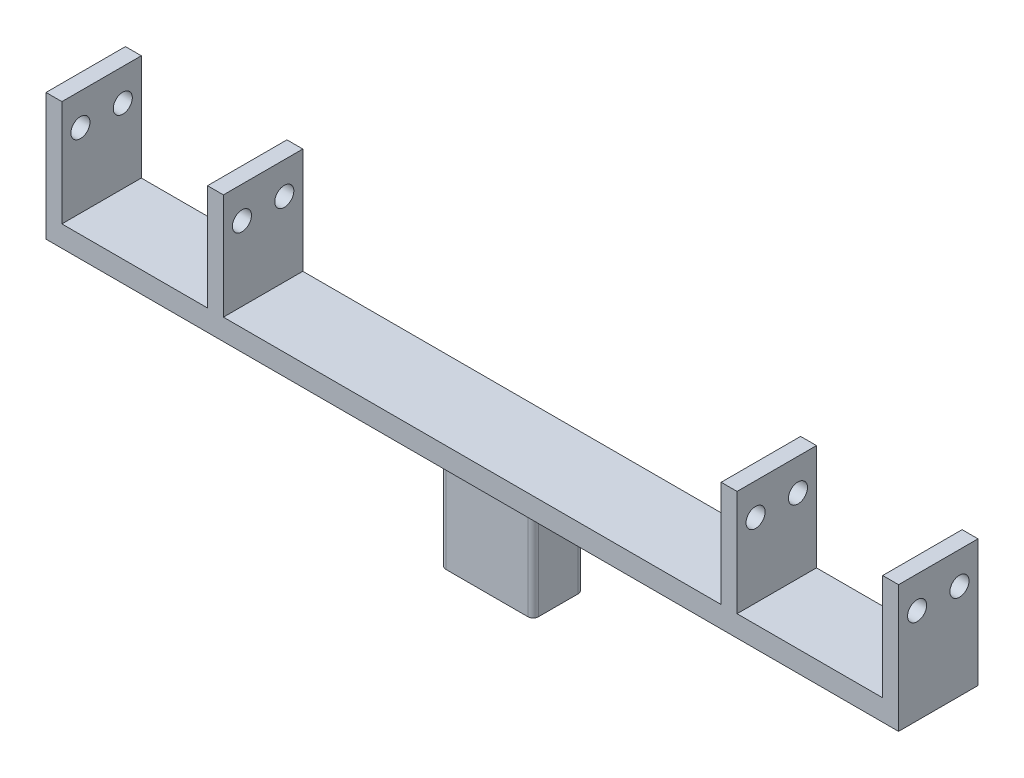
ISO-10303-21;
HEADER;
FILE_DESCRIPTION(('STEP AP214'),'2;1');
FILE_NAME('part.step','',(''),(''),'','','');
FILE_SCHEMA(('AUTOMOTIVE_DESIGN { 1 0 10303 214 1 1 1 1 }'));
ENDSEC;
DATA;
#1=APPLICATION_CONTEXT('core data for automotive mechanical design processes');
#2=APPLICATION_PROTOCOL_DEFINITION('international standard','automotive_design',2000,#1);
#3=PRODUCT_CONTEXT('',#1,'mechanical');
#4=PRODUCT('Part','Part','',(#3));
#5=PRODUCT_RELATED_PRODUCT_CATEGORY('part','',(#4));
#6=PRODUCT_DEFINITION_FORMATION('','',#4);
#7=PRODUCT_DEFINITION_CONTEXT('part definition',#1,'design');
#8=PRODUCT_DEFINITION('design','',#6,#7);
#9=PRODUCT_DEFINITION_SHAPE('','',#8);
#10=(LENGTH_UNIT() NAMED_UNIT(*) SI_UNIT(.MILLI.,.METRE.));
#11=(NAMED_UNIT(*) PLANE_ANGLE_UNIT() SI_UNIT($,.RADIAN.));
#12=(NAMED_UNIT(*) SI_UNIT($,.STERADIAN.) SOLID_ANGLE_UNIT());
#13=UNCERTAINTY_MEASURE_WITH_UNIT(LENGTH_MEASURE(1.E-05),#10,'distance_accuracy_value','');
#14=(GEOMETRIC_REPRESENTATION_CONTEXT(3) GLOBAL_UNCERTAINTY_ASSIGNED_CONTEXT((#13)) GLOBAL_UNIT_ASSIGNED_CONTEXT((#10,
#11,#12)) REPRESENTATION_CONTEXT('',''));
#15=CARTESIAN_POINT('',(0.,0.,0.));
#16=DIRECTION('',(0.,0.,1.));
#17=DIRECTION('',(1.,0.,0.));
#18=AXIS2_PLACEMENT_3D('',#15,#16,#17);
#19=CARTESIAN_POINT('',(0.,0.,0.));
#20=DIRECTION('',(0.,-1.,0.));
#21=DIRECTION('',(0.,0.,-1.));
#22=AXIS2_PLACEMENT_3D('',#19,#20,#21);
#23=PLANE('',#22);
#24=DIRECTION('',(0.,0.,-1.));
#25=VECTOR('',#24,1.);
#26=CARTESIAN_POINT('',(80.5,0.,7.5));
#27=LINE('',#26,#25);
#28=CARTESIAN_POINT('',(80.5,0.,7.5));
#29=VERTEX_POINT('',#28);
#30=CARTESIAN_POINT('',(80.5,0.,-7.5));
#31=VERTEX_POINT('',#30);
#32=EDGE_CURVE('E361',#29,#31,#27,.T.);
#33=ORIENTED_EDGE('',*,*,#32,.F.);
#34=DIRECTION('',(1.,0.,0.));
#35=VECTOR('',#34,1.);
#36=CARTESIAN_POINT('',(-80.5,0.,7.5));
#37=LINE('',#36,#35);
#38=CARTESIAN_POINT('',(-80.5,0.,7.5));
#39=VERTEX_POINT('',#38);
#40=EDGE_CURVE('E377',#39,#29,#37,.T.);
#41=ORIENTED_EDGE('',*,*,#40,.F.);
#42=DIRECTION('',(0.,0.,1.));
#43=VECTOR('',#42,1.);
#44=CARTESIAN_POINT('',(-80.5,0.,7.5));
#45=LINE('',#44,#43);
#46=CARTESIAN_POINT('',(-80.5,0.,-7.5));
#47=VERTEX_POINT('',#46);
#48=EDGE_CURVE('E375',#47,#39,#45,.T.);
#49=ORIENTED_EDGE('',*,*,#48,.F.);
#50=DIRECTION('',(-1.,0.,0.));
#51=VECTOR('',#50,1.);
#52=CARTESIAN_POINT('',(-80.5,0.,-7.5));
#53=LINE('',#52,#51);
#54=EDGE_CURVE('E373',#31,#47,#53,.T.);
#55=ORIENTED_EDGE('',*,*,#54,.F.);
#56=EDGE_LOOP('',(#33,#41,#49,#55));
#57=FACE_BOUND('',#56,.T.);
#58=DIRECTION('',(0.,0.,-1.));
#59=VECTOR('',#58,1.);
#60=CARTESIAN_POINT('',(-8.75,0.,-3.74999999999999));
#61=LINE('',#60,#59);
#62=CARTESIAN_POINT('',(-8.75,0.,3.74999999999999));
#63=VERTEX_POINT('',#62);
#64=CARTESIAN_POINT('',(-8.75,0.,-3.74999999999999));
#65=VERTEX_POINT('',#64);
#66=EDGE_CURVE('E702',#63,#65,#61,.T.);
#67=ORIENTED_EDGE('',*,*,#66,.F.);
#68=CARTESIAN_POINT('',(-7.75,0.,3.75));
#69=DIRECTION('',(0.,-1.,0.));
#70=DIRECTION('',(0.,0.,1.));
#71=AXIS2_PLACEMENT_3D('',#68,#69,#70);
#72=CIRCLE('',#71,1.);
#73=CARTESIAN_POINT('',(-7.74999999999999,0.,4.75));
#74=VERTEX_POINT('',#73);
#75=EDGE_CURVE('E221',#74,#63,#72,.T.);
#76=ORIENTED_EDGE('',*,*,#75,.F.);
#77=DIRECTION('',(-1.,0.,0.));
#78=VECTOR('',#77,1.);
#79=CARTESIAN_POINT('',(-7.74999999999999,0.,4.75));
#80=LINE('',#79,#78);
#81=CARTESIAN_POINT('',(7.74999999999999,0.,4.75));
#82=VERTEX_POINT('',#81);
#83=EDGE_CURVE('E217',#82,#74,#80,.T.);
#84=ORIENTED_EDGE('',*,*,#83,.F.);
#85=CARTESIAN_POINT('',(7.75,0.,3.75));
#86=DIRECTION('',(0.,-1.,0.));
#87=DIRECTION('',(0.,0.,-1.));
#88=AXIS2_PLACEMENT_3D('',#85,#86,#87);
#89=CIRCLE('',#88,1.);
#90=CARTESIAN_POINT('',(8.75,0.,3.74999999999999));
#91=VERTEX_POINT('',#90);
#92=EDGE_CURVE('E698',#91,#82,#89,.T.);
#93=ORIENTED_EDGE('',*,*,#92,.F.);
#94=DIRECTION('',(0.,0.,1.));
#95=VECTOR('',#94,1.);
#96=CARTESIAN_POINT('',(8.75,0.,-3.74999999999999));
#97=LINE('',#96,#95);
#98=CARTESIAN_POINT('',(8.75,0.,-3.74999999999999));
#99=VERTEX_POINT('',#98);
#100=EDGE_CURVE('E714',#99,#91,#97,.T.);
#101=ORIENTED_EDGE('',*,*,#100,.F.);
#102=CARTESIAN_POINT('',(7.75,0.,-3.75));
#103=DIRECTION('',(0.,-1.,0.));
#104=DIRECTION('',(0.,0.,1.));
#105=AXIS2_PLACEMENT_3D('',#102,#103,#104);
#106=CIRCLE('',#105,1.);
#107=CARTESIAN_POINT('',(7.74999999999999,0.,-4.75));
#108=VERTEX_POINT('',#107);
#109=EDGE_CURVE('E712',#108,#99,#106,.T.);
#110=ORIENTED_EDGE('',*,*,#109,.F.);
#111=DIRECTION('',(1.,0.,0.));
#112=VECTOR('',#111,1.);
#113=CARTESIAN_POINT('',(-7.74999999999999,0.,-4.75));
#114=LINE('',#113,#112);
#115=CARTESIAN_POINT('',(-7.74999999999999,0.,-4.75));
#116=VERTEX_POINT('',#115);
#117=EDGE_CURVE('E710',#116,#108,#114,.T.);
#118=ORIENTED_EDGE('',*,*,#117,.F.);
#119=CARTESIAN_POINT('',(-7.75,0.,-3.75));
#120=DIRECTION('',(0.,-1.,0.));
#121=DIRECTION('',(0.,0.,1.));
#122=AXIS2_PLACEMENT_3D('',#119,#120,#121);
#123=CIRCLE('',#122,1.);
#124=EDGE_CURVE('E704',#65,#116,#123,.T.);
#125=ORIENTED_EDGE('',*,*,#124,.F.);
#126=EDGE_LOOP('',(#67,#76,#84,#93,#101,#110,#118,#125));
#127=FACE_BOUND('',#126,.T.);
#128=ADVANCED_FACE('F35',(#57,#127),#23,.T.);
#129=CARTESIAN_POINT('',(0.,4.,0.));
#130=DIRECTION('',(0.,-1.,0.));
#131=DIRECTION('',(0.,0.,-1.));
#132=AXIS2_PLACEMENT_3D('',#129,#130,#131);
#133=PLANE('',#132);
#134=DIRECTION('',(0.,0.,-1.));
#135=VECTOR('',#134,1.);
#136=CARTESIAN_POINT('',(50.,4.,-7.5));
#137=LINE('',#136,#135);
#138=CARTESIAN_POINT('',(50.,4.,7.5));
#139=VERTEX_POINT('',#138);
#140=CARTESIAN_POINT('',(50.,4.,-7.5));
#141=VERTEX_POINT('',#140);
#142=EDGE_CURVE('E271',#139,#141,#137,.T.);
#143=ORIENTED_EDGE('',*,*,#142,.F.);
#144=DIRECTION('',(1.,0.,0.));
#145=VECTOR('',#144,1.);
#146=CARTESIAN_POINT('',(-80.5,4.,7.5));
#147=LINE('',#146,#145);
#148=CARTESIAN_POINT('',(77.5,4.,7.5));
#149=VERTEX_POINT('',#148);
#150=EDGE_CURVE('E364',#139,#149,#147,.T.);
#151=ORIENTED_EDGE('',*,*,#150,.T.);
#152=DIRECTION('',(0.,0.,1.));
#153=VECTOR('',#152,1.);
#154=CARTESIAN_POINT('',(77.5,4.,-7.5));
#155=LINE('',#154,#153);
#156=CARTESIAN_POINT('',(77.5,4.,-7.5));
#157=VERTEX_POINT('',#156);
#158=EDGE_CURVE('E296',#157,#149,#155,.T.);
#159=ORIENTED_EDGE('',*,*,#158,.F.);
#160=DIRECTION('',(-1.,0.,0.));
#161=VECTOR('',#160,1.);
#162=CARTESIAN_POINT('',(-80.5,4.,-7.5));
#163=LINE('',#162,#161);
#164=EDGE_CURVE('E362',#157,#141,#163,.T.);
#165=ORIENTED_EDGE('',*,*,#164,.T.);
#166=EDGE_LOOP('',(#143,#151,#159,#165));
#167=FACE_BOUND('',#166,.T.);
#168=ADVANCED_FACE('F412',(#167),#133,.F.);
#169=DIRECTION('',(0.,0.,1.));
#170=VECTOR('',#169,1.);
#171=CARTESIAN_POINT('',(47.,4.,-7.5));
#172=LINE('',#171,#170);
#173=CARTESIAN_POINT('',(47.,4.,-7.5));
#174=VERTEX_POINT('',#173);
#175=CARTESIAN_POINT('',(47.,4.,7.5));
#176=VERTEX_POINT('',#175);
#177=EDGE_CURVE('E60',#174,#176,#172,.T.);
#178=ORIENTED_EDGE('',*,*,#177,.F.);
#179=CARTESIAN_POINT('',(-47.,4.,-7.5));
#180=VERTEX_POINT('',#179);
#181=EDGE_CURVE('E365',#174,#180,#163,.T.);
#182=ORIENTED_EDGE('',*,*,#181,.T.);
#183=DIRECTION('',(0.,0.,-1.));
#184=VECTOR('',#183,1.);
#185=CARTESIAN_POINT('',(-47.,4.,-7.5));
#186=LINE('',#185,#184);
#187=CARTESIAN_POINT('',(-47.,4.,7.5));
#188=VERTEX_POINT('',#187);
#189=EDGE_CURVE('E339',#188,#180,#186,.T.);
#190=ORIENTED_EDGE('',*,*,#189,.F.);
#191=EDGE_CURVE('E370',#188,#176,#147,.T.);
#192=ORIENTED_EDGE('',*,*,#191,.T.);
#193=EDGE_LOOP('',(#178,#182,#190,#192));
#194=FACE_BOUND('',#193,.T.);
#195=ADVANCED_FACE('F427',(#194),#133,.F.);
#196=DIRECTION('',(0.,0.,-1.));
#197=VECTOR('',#196,1.);
#198=CARTESIAN_POINT('',(-77.5,4.,-7.5));
#199=LINE('',#198,#197);
#200=CARTESIAN_POINT('',(-77.5,4.,7.5));
#201=VERTEX_POINT('',#200);
#202=CARTESIAN_POINT('',(-77.5,4.,-7.5));
#203=VERTEX_POINT('',#202);
#204=EDGE_CURVE('E315',#201,#203,#199,.T.);
#205=ORIENTED_EDGE('',*,*,#204,.F.);
#206=CARTESIAN_POINT('',(-50.,4.,7.5));
#207=VERTEX_POINT('',#206);
#208=EDGE_CURVE('E367',#201,#207,#147,.T.);
#209=ORIENTED_EDGE('',*,*,#208,.T.);
#210=DIRECTION('',(0.,0.,1.));
#211=VECTOR('',#210,1.);
#212=CARTESIAN_POINT('',(-50.,4.,-7.5));
#213=LINE('',#212,#211);
#214=CARTESIAN_POINT('',(-50.,4.,-7.5));
#215=VERTEX_POINT('',#214);
#216=EDGE_CURVE('E334',#215,#207,#213,.T.);
#217=ORIENTED_EDGE('',*,*,#216,.F.);
#218=EDGE_CURVE('E366',#215,#203,#163,.T.);
#219=ORIENTED_EDGE('',*,*,#218,.T.);
#220=EDGE_LOOP('',(#205,#209,#217,#219));
#221=FACE_BOUND('',#220,.T.);
#222=ADVANCED_FACE('F444',(#221),#133,.F.);
#223=CARTESIAN_POINT('',(80.5,4.,7.5));
#224=DIRECTION('',(-1.,0.,0.));
#225=DIRECTION('',(0.,0.,1.));
#226=AXIS2_PLACEMENT_3D('',#223,#224,#225);
#227=PLANE('',#226);
#228=CARTESIAN_POINT('',(80.5,18.,4.));
#229=DIRECTION('',(-1.,0.,0.));
#230=DIRECTION('',(0.,0.,1.));
#231=AXIS2_PLACEMENT_3D('',#228,#229,#230);
#232=CIRCLE('',#231,1.8);
#233=CARTESIAN_POINT('',(80.5,18.,5.8));
#234=VERTEX_POINT('',#233);
#235=EDGE_CURVE('E226',#234,#234,#232,.T.);
#236=ORIENTED_EDGE('',*,*,#235,.T.);
#237=EDGE_LOOP('',(#236));
#238=FACE_BOUND('',#237,.T.);
#239=CARTESIAN_POINT('',(80.5,18.,-4.));
#240=DIRECTION('',(-1.,0.,0.));
#241=DIRECTION('',(0.,0.,1.));
#242=AXIS2_PLACEMENT_3D('',#239,#240,#241);
#243=CIRCLE('',#242,1.8);
#244=CARTESIAN_POINT('',(80.5,18.,-2.2));
#245=VERTEX_POINT('',#244);
#246=EDGE_CURVE('E223',#245,#245,#243,.T.);
#247=ORIENTED_EDGE('',*,*,#246,.T.);
#248=EDGE_LOOP('',(#247));
#249=FACE_BOUND('',#248,.T.);
#250=ORIENTED_EDGE('',*,*,#32,.T.);
#251=DIRECTION('',(0.,-1.,0.));
#252=VECTOR('',#251,1.);
#253=CARTESIAN_POINT('',(80.5,4.,-7.5));
#254=LINE('',#253,#252);
#255=CARTESIAN_POINT('',(80.5,24.,-7.5));
#256=VERTEX_POINT('',#255);
#257=EDGE_CURVE('E11',#256,#31,#254,.T.);
#258=ORIENTED_EDGE('',*,*,#257,.F.);
#259=DIRECTION('',(0.,0.,-1.));
#260=VECTOR('',#259,1.);
#261=CARTESIAN_POINT('',(80.5,24.,-7.5));
#262=LINE('',#261,#260);
#263=CARTESIAN_POINT('',(80.5,24.,7.5));
#264=VERTEX_POINT('',#263);
#265=EDGE_CURVE('E297',#264,#256,#262,.T.);
#266=ORIENTED_EDGE('',*,*,#265,.F.);
#267=DIRECTION('',(0.,-1.,0.));
#268=VECTOR('',#267,1.);
#269=CARTESIAN_POINT('',(80.5,4.,7.5));
#270=LINE('',#269,#268);
#271=EDGE_CURVE('E369',#264,#29,#270,.T.);
#272=ORIENTED_EDGE('',*,*,#271,.T.);
#273=EDGE_LOOP('',(#250,#258,#266,#272));
#274=FACE_BOUND('',#273,.T.);
#275=ADVANCED_FACE('F37',(#238,#249,#274),#227,.F.);
#276=CARTESIAN_POINT('',(-80.5,4.,-7.5));
#277=DIRECTION('',(0.,0.,1.));
#278=DIRECTION('',(1.,0.,0.));
#279=AXIS2_PLACEMENT_3D('',#276,#277,#278);
#280=PLANE('',#279);
#281=ORIENTED_EDGE('',*,*,#54,.T.);
#282=DIRECTION('',(0.,-1.,0.));
#283=VECTOR('',#282,1.);
#284=CARTESIAN_POINT('',(-80.5,4.,-7.5));
#285=LINE('',#284,#283);
#286=CARTESIAN_POINT('',(-80.5,24.,-7.5));
#287=VERTEX_POINT('',#286);
#288=EDGE_CURVE('E44',#287,#47,#285,.T.);
#289=ORIENTED_EDGE('',*,*,#288,.F.);
#290=DIRECTION('',(-1.,0.,0.));
#291=VECTOR('',#290,1.);
#292=CARTESIAN_POINT('',(-80.5,24.,-7.5));
#293=LINE('',#292,#291);
#294=CARTESIAN_POINT('',(-77.5,24.,-7.5));
#295=VERTEX_POINT('',#294);
#296=EDGE_CURVE('E323',#295,#287,#293,.T.);
#297=ORIENTED_EDGE('',*,*,#296,.F.);
#298=DIRECTION('',(0.,-1.,0.));
#299=VECTOR('',#298,1.);
#300=CARTESIAN_POINT('',(-77.5,24.,-7.5));
#301=LINE('',#300,#299);
#302=EDGE_CURVE('E326',#295,#203,#301,.T.);
#303=ORIENTED_EDGE('',*,*,#302,.T.);
#304=ORIENTED_EDGE('',*,*,#218,.F.);
#305=DIRECTION('',(0.,-1.,0.));
#306=VECTOR('',#305,1.);
#307=CARTESIAN_POINT('',(-50.,24.,-7.5));
#308=LINE('',#307,#306);
#309=CARTESIAN_POINT('',(-50.,24.,-7.5));
#310=VERTEX_POINT('',#309);
#311=EDGE_CURVE('E345',#310,#215,#308,.T.);
#312=ORIENTED_EDGE('',*,*,#311,.F.);
#313=DIRECTION('',(-1.,0.,0.));
#314=VECTOR('',#313,1.);
#315=CARTESIAN_POINT('',(-50.,24.,-7.5));
#316=LINE('',#315,#314);
#317=CARTESIAN_POINT('',(-47.,24.,-7.5));
#318=VERTEX_POINT('',#317);
#319=EDGE_CURVE('E343',#318,#310,#316,.T.);
#320=ORIENTED_EDGE('',*,*,#319,.F.);
#321=DIRECTION('',(0.,-1.,0.));
#322=VECTOR('',#321,1.);
#323=CARTESIAN_POINT('',(-47.,24.,-7.5));
#324=LINE('',#323,#322);
#325=EDGE_CURVE('E352',#318,#180,#324,.T.);
#326=ORIENTED_EDGE('',*,*,#325,.T.);
#327=ORIENTED_EDGE('',*,*,#181,.F.);
#328=DIRECTION('',(0.,-1.,0.));
#329=VECTOR('',#328,1.);
#330=CARTESIAN_POINT('',(47.,24.,-7.5));
#331=LINE('',#330,#329);
#332=CARTESIAN_POINT('',(47.,24.,-7.5));
#333=VERTEX_POINT('',#332);
#334=EDGE_CURVE('E290',#333,#174,#331,.T.);
#335=ORIENTED_EDGE('',*,*,#334,.F.);
#336=DIRECTION('',(-1.,0.,0.));
#337=VECTOR('',#336,1.);
#338=CARTESIAN_POINT('',(50.,24.,-7.5));
#339=LINE('',#338,#337);
#340=CARTESIAN_POINT('',(50.,24.,-7.5));
#341=VERTEX_POINT('',#340);
#342=EDGE_CURVE('E275',#341,#333,#339,.T.);
#343=ORIENTED_EDGE('',*,*,#342,.F.);
#344=DIRECTION('',(0.,-1.,0.));
#345=VECTOR('',#344,1.);
#346=CARTESIAN_POINT('',(50.,24.,-7.5));
#347=LINE('',#346,#345);
#348=EDGE_CURVE('E293',#341,#141,#347,.T.);
#349=ORIENTED_EDGE('',*,*,#348,.T.);
#350=ORIENTED_EDGE('',*,*,#164,.F.);
#351=DIRECTION('',(0.,-1.,0.));
#352=VECTOR('',#351,1.);
#353=CARTESIAN_POINT('',(77.5,24.,-7.5));
#354=LINE('',#353,#352);
#355=CARTESIAN_POINT('',(77.5,24.,-7.5));
#356=VERTEX_POINT('',#355);
#357=EDGE_CURVE('E312',#356,#157,#354,.T.);
#358=ORIENTED_EDGE('',*,*,#357,.F.);
#359=DIRECTION('',(-1.,0.,0.));
#360=VECTOR('',#359,1.);
#361=CARTESIAN_POINT('',(80.5,24.,-7.5));
#362=LINE('',#361,#360);
#363=EDGE_CURVE('E300',#256,#356,#362,.T.);
#364=ORIENTED_EDGE('',*,*,#363,.F.);
#365=ORIENTED_EDGE('',*,*,#257,.T.);
#366=EDGE_LOOP('',(#281,#289,#297,#303,#304,#312,#320,#326,#327,#335,#343,#349,#350,#358,#364,#365));
#367=FACE_BOUND('',#366,.T.);
#368=ADVANCED_FACE('F416',(#367),#280,.F.);
#369=CARTESIAN_POINT('',(-80.5,4.,7.5));
#370=DIRECTION('',(1.,0.,0.));
#371=DIRECTION('',(0.,0.,-1.));
#372=AXIS2_PLACEMENT_3D('',#369,#370,#371);
#373=PLANE('',#372);
#374=CARTESIAN_POINT('',(-80.5,18.,4.));
#375=DIRECTION('',(1.,0.,0.));
#376=DIRECTION('',(0.,0.,-1.));
#377=AXIS2_PLACEMENT_3D('',#374,#375,#376);
#378=CIRCLE('',#377,1.8);
#379=CARTESIAN_POINT('',(-80.5,18.,2.2));
#380=VERTEX_POINT('',#379);
#381=EDGE_CURVE('E268',#380,#380,#378,.T.);
#382=ORIENTED_EDGE('',*,*,#381,.T.);
#383=EDGE_LOOP('',(#382));
#384=FACE_BOUND('',#383,.T.);
#385=CARTESIAN_POINT('',(-80.5,18.,-4.));
#386=DIRECTION('',(1.,0.,0.));
#387=DIRECTION('',(0.,0.,-1.));
#388=AXIS2_PLACEMENT_3D('',#385,#386,#387);
#389=CIRCLE('',#388,1.8);
#390=CARTESIAN_POINT('',(-80.5,18.,-5.8));
#391=VERTEX_POINT('',#390);
#392=EDGE_CURVE('E250',#391,#391,#389,.T.);
#393=ORIENTED_EDGE('',*,*,#392,.T.);
#394=EDGE_LOOP('',(#393));
#395=FACE_BOUND('',#394,.T.);
#396=ORIENTED_EDGE('',*,*,#48,.T.);
#397=DIRECTION('',(0.,-1.,0.));
#398=VECTOR('',#397,1.);
#399=CARTESIAN_POINT('',(-80.5,4.,7.5));
#400=LINE('',#399,#398);
#401=CARTESIAN_POINT('',(-80.5,24.,7.5));
#402=VERTEX_POINT('',#401);
#403=EDGE_CURVE('E381',#402,#39,#400,.T.);
#404=ORIENTED_EDGE('',*,*,#403,.F.);
#405=DIRECTION('',(0.,0.,1.));
#406=VECTOR('',#405,1.);
#407=CARTESIAN_POINT('',(-80.5,24.,-7.5));
#408=LINE('',#407,#406);
#409=EDGE_CURVE('E316',#287,#402,#408,.T.);
#410=ORIENTED_EDGE('',*,*,#409,.F.);
#411=ORIENTED_EDGE('',*,*,#288,.T.);
#412=EDGE_LOOP('',(#396,#404,#410,#411));
#413=FACE_BOUND('',#412,.T.);
#414=ADVANCED_FACE('F452',(#384,#395,#413),#373,.F.);
#415=CARTESIAN_POINT('',(-80.5,4.,7.5));
#416=DIRECTION('',(0.,0.,-1.));
#417=DIRECTION('',(-1.,0.,0.));
#418=AXIS2_PLACEMENT_3D('',#415,#416,#417);
#419=PLANE('',#418);
#420=ORIENTED_EDGE('',*,*,#40,.T.);
#421=ORIENTED_EDGE('',*,*,#271,.F.);
#422=DIRECTION('',(1.,0.,0.));
#423=VECTOR('',#422,1.);
#424=CARTESIAN_POINT('',(80.5,24.,7.5));
#425=LINE('',#424,#423);
#426=CARTESIAN_POINT('',(77.5,24.,7.5));
#427=VERTEX_POINT('',#426);
#428=EDGE_CURVE('E304',#427,#264,#425,.T.);
#429=ORIENTED_EDGE('',*,*,#428,.F.);
#430=DIRECTION('',(0.,-1.,0.));
#431=VECTOR('',#430,1.);
#432=CARTESIAN_POINT('',(77.5,24.,7.5));
#433=LINE('',#432,#431);
#434=EDGE_CURVE('E307',#427,#149,#433,.T.);
#435=ORIENTED_EDGE('',*,*,#434,.T.);
#436=ORIENTED_EDGE('',*,*,#150,.F.);
#437=DIRECTION('',(0.,-1.,0.));
#438=VECTOR('',#437,1.);
#439=CARTESIAN_POINT('',(50.,24.,7.5));
#440=LINE('',#439,#438);
#441=CARTESIAN_POINT('',(50.,24.,7.5));
#442=VERTEX_POINT('',#441);
#443=EDGE_CURVE('E281',#442,#139,#440,.T.);
#444=ORIENTED_EDGE('',*,*,#443,.F.);
#445=DIRECTION('',(1.,0.,0.));
#446=VECTOR('',#445,1.);
#447=CARTESIAN_POINT('',(50.,24.,7.5));
#448=LINE('',#447,#446);
#449=CARTESIAN_POINT('',(47.,24.,7.5));
#450=VERTEX_POINT('',#449);
#451=EDGE_CURVE('E279',#450,#442,#448,.T.);
#452=ORIENTED_EDGE('',*,*,#451,.F.);
#453=DIRECTION('',(0.,-1.,0.));
#454=VECTOR('',#453,1.);
#455=CARTESIAN_POINT('',(47.,24.,7.5));
#456=LINE('',#455,#454);
#457=EDGE_CURVE('E287',#450,#176,#456,.T.);
#458=ORIENTED_EDGE('',*,*,#457,.T.);
#459=ORIENTED_EDGE('',*,*,#191,.F.);
#460=DIRECTION('',(0.,-1.,0.));
#461=VECTOR('',#460,1.);
#462=CARTESIAN_POINT('',(-47.,24.,7.5));
#463=LINE('',#462,#461);
#464=CARTESIAN_POINT('',(-47.,24.,7.5));
#465=VERTEX_POINT('',#464);
#466=EDGE_CURVE('E355',#465,#188,#463,.T.);
#467=ORIENTED_EDGE('',*,*,#466,.F.);
#468=DIRECTION('',(1.,0.,0.));
#469=VECTOR('',#468,1.);
#470=CARTESIAN_POINT('',(-50.,24.,7.5));
#471=LINE('',#470,#469);
#472=CARTESIAN_POINT('',(-50.,24.,7.5));
#473=VERTEX_POINT('',#472);
#474=EDGE_CURVE('E338',#473,#465,#471,.T.);
#475=ORIENTED_EDGE('',*,*,#474,.F.);
#476=DIRECTION('',(0.,-1.,0.));
#477=VECTOR('',#476,1.);
#478=CARTESIAN_POINT('',(-50.,24.,7.5));
#479=LINE('',#478,#477);
#480=EDGE_CURVE('E358',#473,#207,#479,.T.);
#481=ORIENTED_EDGE('',*,*,#480,.T.);
#482=ORIENTED_EDGE('',*,*,#208,.F.);
#483=DIRECTION('',(0.,-1.,0.));
#484=VECTOR('',#483,1.);
#485=CARTESIAN_POINT('',(-77.5,24.,7.5));
#486=LINE('',#485,#484);
#487=CARTESIAN_POINT('',(-77.5,24.,7.5));
#488=VERTEX_POINT('',#487);
#489=EDGE_CURVE('E331',#488,#201,#486,.T.);
#490=ORIENTED_EDGE('',*,*,#489,.F.);
#491=DIRECTION('',(1.,0.,0.));
#492=VECTOR('',#491,1.);
#493=CARTESIAN_POINT('',(-80.5,24.,7.5));
#494=LINE('',#493,#492);
#495=EDGE_CURVE('E319',#402,#488,#494,.T.);
#496=ORIENTED_EDGE('',*,*,#495,.F.);
#497=ORIENTED_EDGE('',*,*,#403,.T.);
#498=EDGE_LOOP('',(#420,#421,#429,#435,#436,#444,#452,#458,#459,#467,#475,#481,#482,#490,#496,#497));
#499=FACE_BOUND('',#498,.T.);
#500=ADVANCED_FACE('F423',(#499),#419,.F.);
#501=CARTESIAN_POINT('',(-50.,24.,-7.5));
#502=DIRECTION('',(1.,0.,0.));
#503=DIRECTION('',(0.,0.,-1.));
#504=AXIS2_PLACEMENT_3D('',#501,#502,#503);
#505=PLANE('',#504);
#506=CARTESIAN_POINT('',(-50.,18.,4.));
#507=DIRECTION('',(1.,0.,0.));
#508=DIRECTION('',(0.,0.,-1.));
#509=AXIS2_PLACEMENT_3D('',#506,#507,#508);
#510=CIRCLE('',#509,1.8);
#511=CARTESIAN_POINT('',(-50.,18.,2.2));
#512=VERTEX_POINT('',#511);
#513=EDGE_CURVE('E265',#512,#512,#510,.T.);
#514=ORIENTED_EDGE('',*,*,#513,.T.);
#515=EDGE_LOOP('',(#514));
#516=FACE_BOUND('',#515,.T.);
#517=CARTESIAN_POINT('',(-50.,18.,-4.));
#518=DIRECTION('',(1.,0.,0.));
#519=DIRECTION('',(0.,0.,-1.));
#520=AXIS2_PLACEMENT_3D('',#517,#518,#519);
#521=CIRCLE('',#520,1.8);
#522=CARTESIAN_POINT('',(-50.,18.,-5.8));
#523=VERTEX_POINT('',#522);
#524=EDGE_CURVE('E247',#523,#523,#521,.T.);
#525=ORIENTED_EDGE('',*,*,#524,.T.);
#526=EDGE_LOOP('',(#525));
#527=FACE_BOUND('',#526,.T.);
#528=ORIENTED_EDGE('',*,*,#216,.T.);
#529=ORIENTED_EDGE('',*,*,#480,.F.);
#530=DIRECTION('',(0.,0.,1.));
#531=VECTOR('',#530,1.);
#532=CARTESIAN_POINT('',(-50.,24.,-7.5));
#533=LINE('',#532,#531);
#534=EDGE_CURVE('E335',#310,#473,#533,.T.);
#535=ORIENTED_EDGE('',*,*,#534,.F.);
#536=ORIENTED_EDGE('',*,*,#311,.T.);
#537=EDGE_LOOP('',(#528,#529,#535,#536));
#538=FACE_BOUND('',#537,.T.);
#539=ADVANCED_FACE('F451',(#516,#527,#538),#505,.F.);
#540=CARTESIAN_POINT('',(-47.,24.,-7.5));
#541=DIRECTION('',(-1.,0.,0.));
#542=DIRECTION('',(0.,0.,1.));
#543=AXIS2_PLACEMENT_3D('',#540,#541,#542);
#544=PLANE('',#543);
#545=CARTESIAN_POINT('',(-47.,18.,4.));
#546=DIRECTION('',(-1.,0.,0.));
#547=DIRECTION('',(0.,0.,1.));
#548=AXIS2_PLACEMENT_3D('',#545,#546,#547);
#549=CIRCLE('',#548,1.8);
#550=CARTESIAN_POINT('',(-47.,18.,5.8));
#551=VERTEX_POINT('',#550);
#552=EDGE_CURVE('E262',#551,#551,#549,.T.);
#553=ORIENTED_EDGE('',*,*,#552,.T.);
#554=EDGE_LOOP('',(#553));
#555=FACE_BOUND('',#554,.T.);
#556=CARTESIAN_POINT('',(-47.,18.,-4.));
#557=DIRECTION('',(-1.,0.,0.));
#558=DIRECTION('',(0.,0.,1.));
#559=AXIS2_PLACEMENT_3D('',#556,#557,#558);
#560=CIRCLE('',#559,1.8);
#561=CARTESIAN_POINT('',(-47.,18.,-2.2));
#562=VERTEX_POINT('',#561);
#563=EDGE_CURVE('E244',#562,#562,#560,.T.);
#564=ORIENTED_EDGE('',*,*,#563,.T.);
#565=EDGE_LOOP('',(#564));
#566=FACE_BOUND('',#565,.T.);
#567=ORIENTED_EDGE('',*,*,#189,.T.);
#568=ORIENTED_EDGE('',*,*,#325,.F.);
#569=DIRECTION('',(0.,0.,-1.));
#570=VECTOR('',#569,1.);
#571=CARTESIAN_POINT('',(-47.,24.,-7.5));
#572=LINE('',#571,#570);
#573=EDGE_CURVE('E341',#465,#318,#572,.T.);
#574=ORIENTED_EDGE('',*,*,#573,.F.);
#575=ORIENTED_EDGE('',*,*,#466,.T.);
#576=EDGE_LOOP('',(#567,#568,#574,#575));
#577=FACE_BOUND('',#576,.T.);
#578=ADVANCED_FACE('F497',(#555,#566,#577),#544,.F.);
#579=CARTESIAN_POINT('',(0.,24.,0.));
#580=DIRECTION('',(0.,1.,0.));
#581=DIRECTION('',(0.,0.,1.));
#582=AXIS2_PLACEMENT_3D('',#579,#580,#581);
#583=PLANE('',#582);
#584=ORIENTED_EDGE('',*,*,#534,.T.);
#585=ORIENTED_EDGE('',*,*,#474,.T.);
#586=ORIENTED_EDGE('',*,*,#573,.T.);
#587=ORIENTED_EDGE('',*,*,#319,.T.);
#588=EDGE_LOOP('',(#584,#585,#586,#587));
#589=FACE_BOUND('',#588,.T.);
#590=ADVANCED_FACE('F493',(#589),#583,.T.);
#591=CARTESIAN_POINT('',(-77.5,24.,-7.5));
#592=DIRECTION('',(-1.,0.,0.));
#593=DIRECTION('',(0.,0.,1.));
#594=AXIS2_PLACEMENT_3D('',#591,#592,#593);
#595=PLANE('',#594);
#596=CARTESIAN_POINT('',(-77.5,18.,4.));
#597=DIRECTION('',(-1.,0.,0.));
#598=DIRECTION('',(0.,0.,1.));
#599=AXIS2_PLACEMENT_3D('',#596,#597,#598);
#600=CIRCLE('',#599,1.8);
#601=CARTESIAN_POINT('',(-77.5,18.,5.8));
#602=VERTEX_POINT('',#601);
#603=EDGE_CURVE('E259',#602,#602,#600,.T.);
#604=ORIENTED_EDGE('',*,*,#603,.T.);
#605=EDGE_LOOP('',(#604));
#606=FACE_BOUND('',#605,.T.);
#607=CARTESIAN_POINT('',(-77.5,18.,-4.));
#608=DIRECTION('',(-1.,0.,0.));
#609=DIRECTION('',(0.,0.,1.));
#610=AXIS2_PLACEMENT_3D('',#607,#608,#609);
#611=CIRCLE('',#610,1.8);
#612=CARTESIAN_POINT('',(-77.5,18.,-2.2));
#613=VERTEX_POINT('',#612);
#614=EDGE_CURVE('E241',#613,#613,#611,.T.);
#615=ORIENTED_EDGE('',*,*,#614,.T.);
#616=EDGE_LOOP('',(#615));
#617=FACE_BOUND('',#616,.T.);
#618=ORIENTED_EDGE('',*,*,#204,.T.);
#619=ORIENTED_EDGE('',*,*,#302,.F.);
#620=DIRECTION('',(0.,0.,-1.));
#621=VECTOR('',#620,1.);
#622=CARTESIAN_POINT('',(-77.5,24.,-7.5));
#623=LINE('',#622,#621);
#624=EDGE_CURVE('E321',#488,#295,#623,.T.);
#625=ORIENTED_EDGE('',*,*,#624,.F.);
#626=ORIENTED_EDGE('',*,*,#489,.T.);
#627=EDGE_LOOP('',(#618,#619,#625,#626));
#628=FACE_BOUND('',#627,.T.);
#629=ADVANCED_FACE('F484',(#606,#617,#628),#595,.F.);
#630=CARTESIAN_POINT('',(0.,24.,0.));
#631=DIRECTION('',(0.,1.,0.));
#632=DIRECTION('',(0.,0.,1.));
#633=AXIS2_PLACEMENT_3D('',#630,#631,#632);
#634=PLANE('',#633);
#635=ORIENTED_EDGE('',*,*,#409,.T.);
#636=ORIENTED_EDGE('',*,*,#495,.T.);
#637=ORIENTED_EDGE('',*,*,#624,.T.);
#638=ORIENTED_EDGE('',*,*,#296,.T.);
#639=EDGE_LOOP('',(#635,#636,#637,#638));
#640=FACE_BOUND('',#639,.T.);
#641=ADVANCED_FACE('F480',(#640),#634,.T.);
#642=CARTESIAN_POINT('',(77.5,24.,-7.5));
#643=DIRECTION('',(1.,0.,0.));
#644=DIRECTION('',(0.,0.,-1.));
#645=AXIS2_PLACEMENT_3D('',#642,#643,#644);
#646=PLANE('',#645);
#647=CARTESIAN_POINT('',(77.5,18.,4.));
#648=DIRECTION('',(1.,0.,0.));
#649=DIRECTION('',(0.,0.,-1.));
#650=AXIS2_PLACEMENT_3D('',#647,#648,#649);
#651=CIRCLE('',#650,1.8);
#652=CARTESIAN_POINT('',(77.5,18.,2.2));
#653=VERTEX_POINT('',#652);
#654=EDGE_CURVE('E256',#653,#653,#651,.T.);
#655=ORIENTED_EDGE('',*,*,#654,.T.);
#656=EDGE_LOOP('',(#655));
#657=FACE_BOUND('',#656,.T.);
#658=CARTESIAN_POINT('',(77.5,18.,-4.));
#659=DIRECTION('',(1.,0.,0.));
#660=DIRECTION('',(0.,0.,-1.));
#661=AXIS2_PLACEMENT_3D('',#658,#659,#660);
#662=CIRCLE('',#661,1.8);
#663=CARTESIAN_POINT('',(77.5,18.,-5.8));
#664=VERTEX_POINT('',#663);
#665=EDGE_CURVE('E238',#664,#664,#662,.T.);
#666=ORIENTED_EDGE('',*,*,#665,.T.);
#667=EDGE_LOOP('',(#666));
#668=FACE_BOUND('',#667,.T.);
#669=ORIENTED_EDGE('',*,*,#158,.T.);
#670=ORIENTED_EDGE('',*,*,#434,.F.);
#671=DIRECTION('',(0.,0.,1.));
#672=VECTOR('',#671,1.);
#673=CARTESIAN_POINT('',(77.5,24.,-7.5));
#674=LINE('',#673,#672);
#675=EDGE_CURVE('E302',#356,#427,#674,.T.);
#676=ORIENTED_EDGE('',*,*,#675,.F.);
#677=ORIENTED_EDGE('',*,*,#357,.T.);
#678=EDGE_LOOP('',(#669,#670,#676,#677));
#679=FACE_BOUND('',#678,.T.);
#680=ADVANCED_FACE('F514',(#657,#668,#679),#646,.F.);
#681=CARTESIAN_POINT('',(0.,24.,0.));
#682=DIRECTION('',(0.,-1.,0.));
#683=DIRECTION('',(0.,0.,-1.));
#684=AXIS2_PLACEMENT_3D('',#681,#682,#683);
#685=PLANE('',#684);
#686=ORIENTED_EDGE('',*,*,#265,.T.);
#687=ORIENTED_EDGE('',*,*,#363,.T.);
#688=ORIENTED_EDGE('',*,*,#675,.T.);
#689=ORIENTED_EDGE('',*,*,#428,.T.);
#690=EDGE_LOOP('',(#686,#687,#688,#689));
#691=FACE_BOUND('',#690,.T.);
#692=ADVANCED_FACE('F404',(#691),#685,.F.);
#693=CARTESIAN_POINT('',(50.,24.,-7.5));
#694=DIRECTION('',(-1.,0.,0.));
#695=DIRECTION('',(0.,0.,1.));
#696=AXIS2_PLACEMENT_3D('',#693,#694,#695);
#697=PLANE('',#696);
#698=CARTESIAN_POINT('',(50.,18.,4.));
#699=DIRECTION('',(-1.,0.,0.));
#700=DIRECTION('',(0.,0.,1.));
#701=AXIS2_PLACEMENT_3D('',#698,#699,#700);
#702=CIRCLE('',#701,1.8);
#703=CARTESIAN_POINT('',(50.,18.,5.8));
#704=VERTEX_POINT('',#703);
#705=EDGE_CURVE('E253',#704,#704,#702,.T.);
#706=ORIENTED_EDGE('',*,*,#705,.T.);
#707=EDGE_LOOP('',(#706));
#708=FACE_BOUND('',#707,.T.);
#709=CARTESIAN_POINT('',(50.,18.,-4.));
#710=DIRECTION('',(-1.,0.,0.));
#711=DIRECTION('',(0.,0.,1.));
#712=AXIS2_PLACEMENT_3D('',#709,#710,#711);
#713=CIRCLE('',#712,1.8);
#714=CARTESIAN_POINT('',(50.,18.,-2.2));
#715=VERTEX_POINT('',#714);
#716=EDGE_CURVE('E235',#715,#715,#713,.T.);
#717=ORIENTED_EDGE('',*,*,#716,.T.);
#718=EDGE_LOOP('',(#717));
#719=FACE_BOUND('',#718,.T.);
#720=ORIENTED_EDGE('',*,*,#142,.T.);
#721=ORIENTED_EDGE('',*,*,#348,.F.);
#722=DIRECTION('',(0.,0.,-1.));
#723=VECTOR('',#722,1.);
#724=CARTESIAN_POINT('',(50.,24.,-7.5));
#725=LINE('',#724,#723);
#726=EDGE_CURVE('E272',#442,#341,#725,.T.);
#727=ORIENTED_EDGE('',*,*,#726,.F.);
#728=ORIENTED_EDGE('',*,*,#443,.T.);
#729=EDGE_LOOP('',(#720,#721,#727,#728));
#730=FACE_BOUND('',#729,.T.);
#731=ADVANCED_FACE('F401',(#708,#719,#730),#697,.F.);
#732=CARTESIAN_POINT('',(47.,24.,-7.5));
#733=DIRECTION('',(1.,0.,0.));
#734=DIRECTION('',(0.,0.,-1.));
#735=AXIS2_PLACEMENT_3D('',#732,#733,#734);
#736=PLANE('',#735);
#737=CARTESIAN_POINT('',(47.,18.,4.));
#738=DIRECTION('',(1.,0.,0.));
#739=DIRECTION('',(0.,0.,-1.));
#740=AXIS2_PLACEMENT_3D('',#737,#738,#739);
#741=CIRCLE('',#740,1.8);
#742=CARTESIAN_POINT('',(47.,18.,2.2));
#743=VERTEX_POINT('',#742);
#744=EDGE_CURVE('E39',#743,#743,#741,.T.);
#745=ORIENTED_EDGE('',*,*,#744,.T.);
#746=EDGE_LOOP('',(#745));
#747=FACE_BOUND('',#746,.T.);
#748=CARTESIAN_POINT('',(47.,18.,-4.));
#749=DIRECTION('',(1.,0.,0.));
#750=DIRECTION('',(0.,0.,-1.));
#751=AXIS2_PLACEMENT_3D('',#748,#749,#750);
#752=CIRCLE('',#751,1.8);
#753=CARTESIAN_POINT('',(47.,18.,-5.8));
#754=VERTEX_POINT('',#753);
#755=EDGE_CURVE('E233',#754,#754,#752,.T.);
#756=ORIENTED_EDGE('',*,*,#755,.T.);
#757=EDGE_LOOP('',(#756));
#758=FACE_BOUND('',#757,.T.);
#759=ORIENTED_EDGE('',*,*,#177,.T.);
#760=ORIENTED_EDGE('',*,*,#457,.F.);
#761=DIRECTION('',(0.,0.,1.));
#762=VECTOR('',#761,1.);
#763=CARTESIAN_POINT('',(47.,24.,-7.5));
#764=LINE('',#763,#762);
#765=EDGE_CURVE('E277',#333,#450,#764,.T.);
#766=ORIENTED_EDGE('',*,*,#765,.F.);
#767=ORIENTED_EDGE('',*,*,#334,.T.);
#768=EDGE_LOOP('',(#759,#760,#766,#767));
#769=FACE_BOUND('',#768,.T.);
#770=ADVANCED_FACE('F388',(#747,#758,#769),#736,.F.);
#771=CARTESIAN_POINT('',(0.,24.,0.));
#772=DIRECTION('',(0.,-1.,0.));
#773=DIRECTION('',(0.,0.,-1.));
#774=AXIS2_PLACEMENT_3D('',#771,#772,#773);
#775=PLANE('',#774);
#776=ORIENTED_EDGE('',*,*,#726,.T.);
#777=ORIENTED_EDGE('',*,*,#342,.T.);
#778=ORIENTED_EDGE('',*,*,#765,.T.);
#779=ORIENTED_EDGE('',*,*,#451,.T.);
#780=EDGE_LOOP('',(#776,#777,#778,#779));
#781=FACE_BOUND('',#780,.T.);
#782=ADVANCED_FACE('F395',(#781),#775,.F.);
#783=CARTESIAN_POINT('',(80.5,18.,-4.));
#784=DIRECTION('',(-1.,0.,0.));
#785=DIRECTION('',(0.,0.,1.));
#786=AXIS2_PLACEMENT_3D('',#783,#784,#785);
#787=CYLINDRICAL_SURFACE('',#786,1.8);
#788=ORIENTED_EDGE('',*,*,#755,.F.);
#789=EDGE_LOOP('',(#788));
#790=FACE_BOUND('',#789,.T.);
#791=ORIENTED_EDGE('',*,*,#716,.F.);
#792=EDGE_LOOP('',(#791));
#793=FACE_BOUND('',#792,.T.);
#794=ADVANCED_FACE('F391',(#790,#793),#787,.F.);
#795=CARTESIAN_POINT('',(80.5,18.,4.));
#796=DIRECTION('',(-1.,0.,0.));
#797=DIRECTION('',(0.,0.,1.));
#798=AXIS2_PLACEMENT_3D('',#795,#796,#797);
#799=CYLINDRICAL_SURFACE('',#798,1.8);
#800=ORIENTED_EDGE('',*,*,#744,.F.);
#801=EDGE_LOOP('',(#800));
#802=FACE_BOUND('',#801,.T.);
#803=ORIENTED_EDGE('',*,*,#705,.F.);
#804=EDGE_LOOP('',(#803));
#805=FACE_BOUND('',#804,.T.);
#806=ADVANCED_FACE('F394',(#802,#805),#799,.F.);
#807=ORIENTED_EDGE('',*,*,#246,.F.);
#808=EDGE_LOOP('',(#807));
#809=FACE_BOUND('',#808,.T.);
#810=ORIENTED_EDGE('',*,*,#665,.F.);
#811=EDGE_LOOP('',(#810));
#812=FACE_BOUND('',#811,.T.);
#813=ADVANCED_FACE('F398',(#809,#812),#787,.F.);
#814=ORIENTED_EDGE('',*,*,#235,.F.);
#815=EDGE_LOOP('',(#814));
#816=FACE_BOUND('',#815,.T.);
#817=ORIENTED_EDGE('',*,*,#654,.F.);
#818=EDGE_LOOP('',(#817));
#819=FACE_BOUND('',#818,.T.);
#820=ADVANCED_FACE('F555',(#816,#819),#799,.F.);
#821=ORIENTED_EDGE('',*,*,#614,.F.);
#822=EDGE_LOOP('',(#821));
#823=FACE_BOUND('',#822,.T.);
#824=ORIENTED_EDGE('',*,*,#392,.F.);
#825=EDGE_LOOP('',(#824));
#826=FACE_BOUND('',#825,.T.);
#827=ADVANCED_FACE('F397',(#823,#826),#787,.F.);
#828=ORIENTED_EDGE('',*,*,#603,.F.);
#829=EDGE_LOOP('',(#828));
#830=FACE_BOUND('',#829,.T.);
#831=ORIENTED_EDGE('',*,*,#381,.F.);
#832=EDGE_LOOP('',(#831));
#833=FACE_BOUND('',#832,.T.);
#834=ADVANCED_FACE('F554',(#830,#833),#799,.F.);
#835=ORIENTED_EDGE('',*,*,#563,.F.);
#836=EDGE_LOOP('',(#835));
#837=FACE_BOUND('',#836,.T.);
#838=ORIENTED_EDGE('',*,*,#524,.F.);
#839=EDGE_LOOP('',(#838));
#840=FACE_BOUND('',#839,.T.);
#841=ADVANCED_FACE('F564',(#837,#840),#787,.F.);
#842=ORIENTED_EDGE('',*,*,#552,.F.);
#843=EDGE_LOOP('',(#842));
#844=FACE_BOUND('',#843,.T.);
#845=ORIENTED_EDGE('',*,*,#513,.F.);
#846=EDGE_LOOP('',(#845));
#847=FACE_BOUND('',#846,.T.);
#848=ADVANCED_FACE('F573',(#844,#847),#799,.F.);
#849=CARTESIAN_POINT('',(-7.75,-19.,3.75));
#850=DIRECTION('',(0.,1.,0.));
#851=DIRECTION('',(0.,0.,1.));
#852=AXIS2_PLACEMENT_3D('',#849,#850,#851);
#853=CYLINDRICAL_SURFACE('',#852,1.);
#854=ORIENTED_EDGE('',*,*,#75,.T.);
#855=DIRECTION('',(0.,1.,0.));
#856=VECTOR('',#855,1.);
#857=CARTESIAN_POINT('',(-8.75,-19.,3.74999999999999));
#858=LINE('',#857,#856);
#859=CARTESIAN_POINT('',(-8.75,-19.,3.74999999999999));
#860=VERTEX_POINT('',#859);
#861=EDGE_CURVE('E202',#860,#63,#858,.T.);
#862=ORIENTED_EDGE('',*,*,#861,.F.);
#863=CARTESIAN_POINT('',(-7.75,-19.,3.75));
#864=DIRECTION('',(0.,-1.,0.));
#865=DIRECTION('',(0.,0.,1.));
#866=AXIS2_PLACEMENT_3D('',#863,#864,#865);
#867=CIRCLE('',#866,1.);
#868=CARTESIAN_POINT('',(-7.74999999999999,-19.,4.75));
#869=VERTEX_POINT('',#868);
#870=EDGE_CURVE('E209',#869,#860,#867,.T.);
#871=ORIENTED_EDGE('',*,*,#870,.F.);
#872=DIRECTION('',(0.,1.,0.));
#873=VECTOR('',#872,1.);
#874=CARTESIAN_POINT('',(-7.74999999999999,-19.,4.75));
#875=LINE('',#874,#873);
#876=EDGE_CURVE('E696',#869,#74,#875,.T.);
#877=ORIENTED_EDGE('',*,*,#876,.T.);
#878=EDGE_LOOP('',(#854,#862,#871,#877));
#879=FACE_BOUND('',#878,.T.);
#880=ADVANCED_FACE('F219',(#879),#853,.T.);
#881=CARTESIAN_POINT('',(-8.75,-19.,-3.74999999999999));
#882=DIRECTION('',(1.,0.,0.));
#883=DIRECTION('',(0.,0.,-1.));
#884=AXIS2_PLACEMENT_3D('',#881,#882,#883);
#885=PLANE('',#884);
#886=ORIENTED_EDGE('',*,*,#66,.T.);
#887=DIRECTION('',(0.,1.,0.));
#888=VECTOR('',#887,1.);
#889=CARTESIAN_POINT('',(-8.75,-19.,-3.74999999999999));
#890=LINE('',#889,#888);
#891=CARTESIAN_POINT('',(-8.75,-19.,-3.74999999999999));
#892=VERTEX_POINT('',#891);
#893=EDGE_CURVE('E205',#892,#65,#890,.T.);
#894=ORIENTED_EDGE('',*,*,#893,.F.);
#895=DIRECTION('',(0.,0.,-1.));
#896=VECTOR('',#895,1.);
#897=CARTESIAN_POINT('',(-8.75,-19.,-3.74999999999999));
#898=LINE('',#897,#896);
#899=EDGE_CURVE('E198',#860,#892,#898,.T.);
#900=ORIENTED_EDGE('',*,*,#899,.F.);
#901=ORIENTED_EDGE('',*,*,#861,.T.);
#902=EDGE_LOOP('',(#886,#894,#900,#901));
#903=FACE_BOUND('',#902,.T.);
#904=ADVANCED_FACE('F200',(#903),#885,.F.);
#905=CARTESIAN_POINT('',(-7.75,-19.,-3.75));
#906=DIRECTION('',(0.,1.,0.));
#907=DIRECTION('',(0.,0.,1.));
#908=AXIS2_PLACEMENT_3D('',#905,#906,#907);
#909=CYLINDRICAL_SURFACE('',#908,1.);
#910=ORIENTED_EDGE('',*,*,#124,.T.);
#911=DIRECTION('',(0.,1.,0.));
#912=VECTOR('',#911,1.);
#913=CARTESIAN_POINT('',(-7.74999999999999,-19.,-4.75));
#914=LINE('',#913,#912);
#915=CARTESIAN_POINT('',(-7.74999999999999,-19.,-4.75));
#916=VERTEX_POINT('',#915);
#917=EDGE_CURVE('E228',#916,#116,#914,.T.);
#918=ORIENTED_EDGE('',*,*,#917,.F.);
#919=CARTESIAN_POINT('',(-7.75,-19.,-3.75));
#920=DIRECTION('',(0.,-1.,0.));
#921=DIRECTION('',(0.,0.,1.));
#922=AXIS2_PLACEMENT_3D('',#919,#920,#921);
#923=CIRCLE('',#922,1.);
#924=EDGE_CURVE('E208',#892,#916,#923,.T.);
#925=ORIENTED_EDGE('',*,*,#924,.F.);
#926=ORIENTED_EDGE('',*,*,#893,.T.);
#927=EDGE_LOOP('',(#910,#918,#925,#926));
#928=FACE_BOUND('',#927,.T.);
#929=ADVANCED_FACE('F625',(#928),#909,.T.);
#930=CARTESIAN_POINT('',(-7.74999999999999,-19.,-4.75));
#931=DIRECTION('',(0.,0.,1.));
#932=DIRECTION('',(1.,0.,0.));
#933=AXIS2_PLACEMENT_3D('',#930,#931,#932);
#934=PLANE('',#933);
#935=ORIENTED_EDGE('',*,*,#117,.T.);
#936=DIRECTION('',(0.,1.,0.));
#937=VECTOR('',#936,1.);
#938=CARTESIAN_POINT('',(7.74999999999999,-19.,-4.75));
#939=LINE('',#938,#937);
#940=CARTESIAN_POINT('',(7.74999999999999,-19.,-4.75));
#941=VERTEX_POINT('',#940);
#942=EDGE_CURVE('E724',#941,#108,#939,.T.);
#943=ORIENTED_EDGE('',*,*,#942,.F.);
#944=DIRECTION('',(1.,0.,0.));
#945=VECTOR('',#944,1.);
#946=CARTESIAN_POINT('',(-7.74999999999999,-19.,-4.75));
#947=LINE('',#946,#945);
#948=EDGE_CURVE('E731',#916,#941,#947,.T.);
#949=ORIENTED_EDGE('',*,*,#948,.F.);
#950=ORIENTED_EDGE('',*,*,#917,.T.);
#951=EDGE_LOOP('',(#935,#943,#949,#950));
#952=FACE_BOUND('',#951,.T.);
#953=ADVANCED_FACE('F634',(#952),#934,.F.);
#954=CARTESIAN_POINT('',(7.75,-19.,-3.75));
#955=DIRECTION('',(0.,1.,0.));
#956=DIRECTION('',(0.,0.,1.));
#957=AXIS2_PLACEMENT_3D('',#954,#955,#956);
#958=CYLINDRICAL_SURFACE('',#957,1.);
#959=ORIENTED_EDGE('',*,*,#109,.T.);
#960=DIRECTION('',(0.,1.,0.));
#961=VECTOR('',#960,1.);
#962=CARTESIAN_POINT('',(8.75,-19.,-3.74999999999999));
#963=LINE('',#962,#961);
#964=CARTESIAN_POINT('',(8.75,-19.,-3.74999999999999));
#965=VERTEX_POINT('',#964);
#966=EDGE_CURVE('E721',#965,#99,#963,.T.);
#967=ORIENTED_EDGE('',*,*,#966,.F.);
#968=CARTESIAN_POINT('',(7.75,-19.,-3.75));
#969=DIRECTION('',(0.,-1.,0.));
#970=DIRECTION('',(0.,0.,1.));
#971=AXIS2_PLACEMENT_3D('',#968,#969,#970);
#972=CIRCLE('',#971,1.);
#973=EDGE_CURVE('E741',#941,#965,#972,.T.);
#974=ORIENTED_EDGE('',*,*,#973,.F.);
#975=ORIENTED_EDGE('',*,*,#942,.T.);
#976=EDGE_LOOP('',(#959,#967,#974,#975));
#977=FACE_BOUND('',#976,.T.);
#978=ADVANCED_FACE('F644',(#977),#958,.T.);
#979=CARTESIAN_POINT('',(8.75,-19.,-3.74999999999999));
#980=DIRECTION('',(-1.,0.,0.));
#981=DIRECTION('',(0.,0.,1.));
#982=AXIS2_PLACEMENT_3D('',#979,#980,#981);
#983=PLANE('',#982);
#984=ORIENTED_EDGE('',*,*,#100,.T.);
#985=DIRECTION('',(0.,1.,0.));
#986=VECTOR('',#985,1.);
#987=CARTESIAN_POINT('',(8.75,-19.,3.74999999999999));
#988=LINE('',#987,#986);
#989=CARTESIAN_POINT('',(8.75,-19.,3.74999999999999));
#990=VERTEX_POINT('',#989);
#991=EDGE_CURVE('E718',#990,#91,#988,.T.);
#992=ORIENTED_EDGE('',*,*,#991,.F.);
#993=DIRECTION('',(0.,0.,1.));
#994=VECTOR('',#993,1.);
#995=CARTESIAN_POINT('',(8.75,-19.,-3.74999999999999));
#996=LINE('',#995,#994);
#997=EDGE_CURVE('E738',#965,#990,#996,.T.);
#998=ORIENTED_EDGE('',*,*,#997,.F.);
#999=ORIENTED_EDGE('',*,*,#966,.T.);
#1000=EDGE_LOOP('',(#984,#992,#998,#999));
#1001=FACE_BOUND('',#1000,.T.);
#1002=ADVANCED_FACE('F654',(#1001),#983,.F.);
#1003=CARTESIAN_POINT('',(7.75,-19.,3.75));
#1004=DIRECTION('',(0.,1.,0.));
#1005=DIRECTION('',(0.,0.,1.));
#1006=AXIS2_PLACEMENT_3D('',#1003,#1004,#1005);
#1007=CYLINDRICAL_SURFACE('',#1006,1.);
#1008=ORIENTED_EDGE('',*,*,#92,.T.);
#1009=DIRECTION('',(0.,1.,0.));
#1010=VECTOR('',#1009,1.);
#1011=CARTESIAN_POINT('',(7.74999999999999,-19.,4.75));
#1012=LINE('',#1011,#1010);
#1013=CARTESIAN_POINT('',(7.74999999999999,-19.,4.75));
#1014=VERTEX_POINT('',#1013);
#1015=EDGE_CURVE('E52',#1014,#82,#1012,.T.);
#1016=ORIENTED_EDGE('',*,*,#1015,.F.);
#1017=CARTESIAN_POINT('',(7.75,-19.,3.75));
#1018=DIRECTION('',(0.,-1.,0.));
#1019=DIRECTION('',(0.,0.,-1.));
#1020=AXIS2_PLACEMENT_3D('',#1017,#1018,#1019);
#1021=CIRCLE('',#1020,1.);
#1022=EDGE_CURVE('E740',#990,#1014,#1021,.T.);
#1023=ORIENTED_EDGE('',*,*,#1022,.F.);
#1024=ORIENTED_EDGE('',*,*,#991,.T.);
#1025=EDGE_LOOP('',(#1008,#1016,#1023,#1024));
#1026=FACE_BOUND('',#1025,.T.);
#1027=ADVANCED_FACE('F664',(#1026),#1007,.T.);
#1028=CARTESIAN_POINT('',(-7.74999999999999,-19.,4.75));
#1029=DIRECTION('',(0.,0.,-1.));
#1030=DIRECTION('',(-1.,0.,0.));
#1031=AXIS2_PLACEMENT_3D('',#1028,#1029,#1030);
#1032=PLANE('',#1031);
#1033=ORIENTED_EDGE('',*,*,#83,.T.);
#1034=ORIENTED_EDGE('',*,*,#876,.F.);
#1035=DIRECTION('',(-1.,0.,0.));
#1036=VECTOR('',#1035,1.);
#1037=CARTESIAN_POINT('',(-7.74999999999999,-19.,4.75));
#1038=LINE('',#1037,#1036);
#1039=EDGE_CURVE('E213',#1014,#869,#1038,.T.);
#1040=ORIENTED_EDGE('',*,*,#1039,.F.);
#1041=ORIENTED_EDGE('',*,*,#1015,.T.);
#1042=EDGE_LOOP('',(#1033,#1034,#1040,#1041));
#1043=FACE_BOUND('',#1042,.T.);
#1044=ADVANCED_FACE('F674',(#1043),#1032,.F.);
#1045=CARTESIAN_POINT('',(-7.75,-19.,3.75));
#1046=DIRECTION('',(0.,1.,0.));
#1047=DIRECTION('',(0.,0.,1.));
#1048=AXIS2_PLACEMENT_3D('',#1045,#1046,#1047);
#1049=PLANE('',#1048);
#1050=ORIENTED_EDGE('',*,*,#870,.T.);
#1051=ORIENTED_EDGE('',*,*,#899,.T.);
#1052=ORIENTED_EDGE('',*,*,#924,.T.);
#1053=ORIENTED_EDGE('',*,*,#948,.T.);
#1054=ORIENTED_EDGE('',*,*,#973,.T.);
#1055=ORIENTED_EDGE('',*,*,#997,.T.);
#1056=ORIENTED_EDGE('',*,*,#1022,.T.);
#1057=ORIENTED_EDGE('',*,*,#1039,.T.);
#1058=EDGE_LOOP('',(#1050,#1051,#1052,#1053,#1054,#1055,#1056,#1057));
#1059=FACE_BOUND('',#1058,.T.);
#1060=ADVANCED_FACE('F212',(#1059),#1049,.F.);
#1061=CLOSED_SHELL('',(#128,#168,#195,#222,#275,#368,#414,#500,#539,#578,#590,#629,#641,#680,
#692,#731,#770,#782,#794,#806,#813,#820,#827,#834,#841,#848,#880,#904,#929,#953,#978,#1002,
#1027,#1044,#1060));
#1062=MANIFOLD_SOLID_BREP('B2',#1061);
#1063=ADVANCED_BREP_SHAPE_REPRESENTATION('',(#18,#1062),#14);
#1064=SHAPE_DEFINITION_REPRESENTATION(#9,#1063);
ENDSEC;
END-ISO-10303-21;
